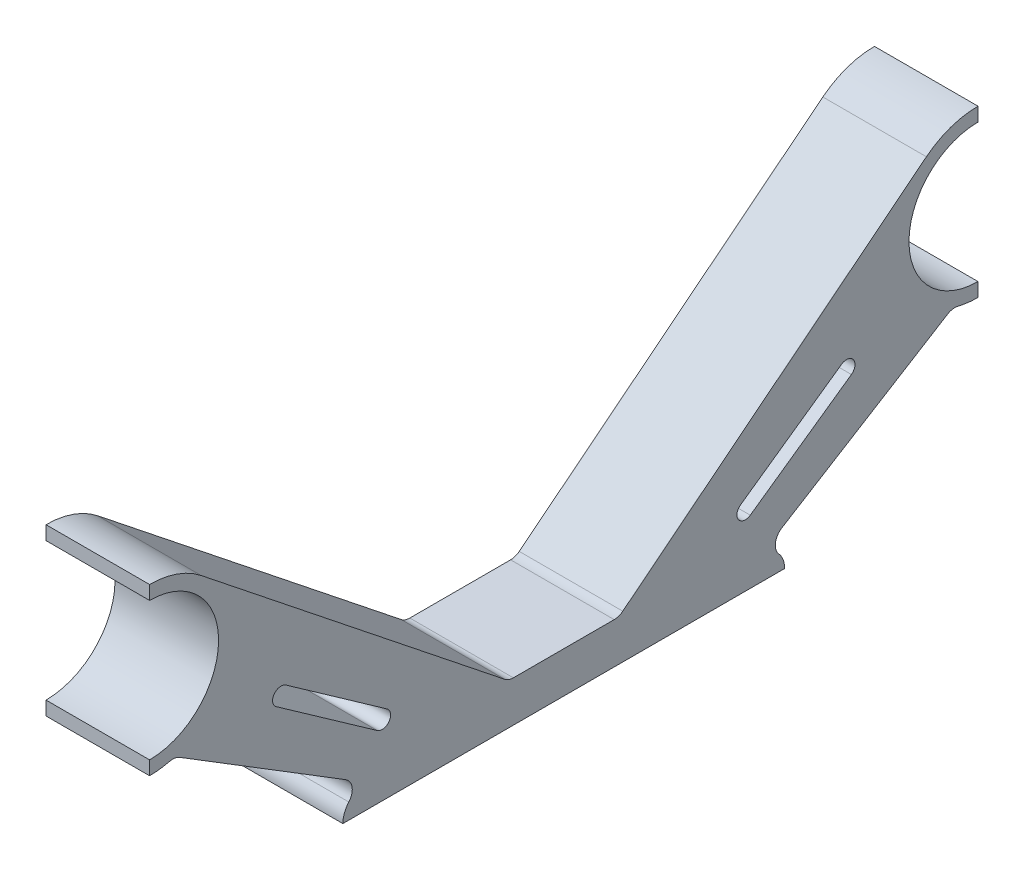
ISO-10303-21;
HEADER;
FILE_DESCRIPTION(('STEP AP214'),'2;1');
FILE_NAME('part.step','',(''),(''),'','','');
FILE_SCHEMA(('AUTOMOTIVE_DESIGN { 1 0 10303 214 1 1 1 1 }'));
ENDSEC;
DATA;
#1=APPLICATION_CONTEXT('core data for automotive mechanical design processes');
#2=APPLICATION_PROTOCOL_DEFINITION('international standard','automotive_design',2000,#1);
#3=PRODUCT_CONTEXT('',#1,'mechanical');
#4=PRODUCT('Part','Part','',(#3));
#5=PRODUCT_RELATED_PRODUCT_CATEGORY('part','',(#4));
#6=PRODUCT_DEFINITION_FORMATION('','',#4);
#7=PRODUCT_DEFINITION_CONTEXT('part definition',#1,'design');
#8=PRODUCT_DEFINITION('design','',#6,#7);
#9=PRODUCT_DEFINITION_SHAPE('','',#8);
#10=(LENGTH_UNIT() NAMED_UNIT(*) SI_UNIT(.MILLI.,.METRE.));
#11=(NAMED_UNIT(*) PLANE_ANGLE_UNIT() SI_UNIT($,.RADIAN.));
#12=(NAMED_UNIT(*) SI_UNIT($,.STERADIAN.) SOLID_ANGLE_UNIT());
#13=UNCERTAINTY_MEASURE_WITH_UNIT(LENGTH_MEASURE(1.E-05),#10,'distance_accuracy_value','');
#14=(GEOMETRIC_REPRESENTATION_CONTEXT(3) GLOBAL_UNCERTAINTY_ASSIGNED_CONTEXT((#13)) GLOBAL_UNIT_ASSIGNED_CONTEXT((#10,
#11,#12)) REPRESENTATION_CONTEXT('',''));
#15=CARTESIAN_POINT('',(0.,0.,0.));
#16=DIRECTION('',(0.,0.,1.));
#17=DIRECTION('',(1.,0.,0.));
#18=AXIS2_PLACEMENT_3D('',#15,#16,#17);
#19=CARTESIAN_POINT('',(3.75,16.,30.));
#20=DIRECTION('',(1.,0.,0.));
#21=DIRECTION('',(0.,0.,-1.));
#22=AXIS2_PLACEMENT_3D('',#19,#20,#21);
#23=PLANE('',#22);
#24=CARTESIAN_POINT('',(3.75,16.,30.));
#25=DIRECTION('',(1.,0.,0.));
#26=DIRECTION('',(0.,0.,-1.));
#27=AXIS2_PLACEMENT_3D('',#24,#25,#26);
#28=CIRCLE('',#27,6.);
#29=CARTESIAN_POINT('',(3.75,20.6940977194005,26.2629628579958));
#30=VERTEX_POINT('',#29);
#31=CARTESIAN_POINT('',(3.75,22.,30.));
#32=VERTEX_POINT('',#31);
#33=EDGE_CURVE('E314',#30,#32,#28,.T.);
#34=ORIENTED_EDGE('',*,*,#33,.T.);
#35=DIRECTION('',(0.,-1.,0.));
#36=VECTOR('',#35,1.);
#37=CARTESIAN_POINT('',(3.75,22.,30.));
#38=LINE('',#37,#36);
#39=CARTESIAN_POINT('',(3.75,21.,30.));
#40=VERTEX_POINT('',#39);
#41=EDGE_CURVE('E317',#32,#40,#38,.T.);
#42=ORIENTED_EDGE('',*,*,#41,.T.);
#43=CARTESIAN_POINT('',(3.75,16.,30.));
#44=DIRECTION('',(-1.,0.,0.));
#45=DIRECTION('',(0.,0.,-1.));
#46=AXIS2_PLACEMENT_3D('',#43,#44,#45);
#47=CIRCLE('',#46,5.);
#48=CARTESIAN_POINT('',(3.75,11.,30.));
#49=VERTEX_POINT('',#48);
#50=EDGE_CURVE('E320',#40,#49,#47,.T.);
#51=ORIENTED_EDGE('',*,*,#50,.T.);
#52=DIRECTION('',(0.,-1.,0.));
#53=VECTOR('',#52,1.);
#54=CARTESIAN_POINT('',(3.75,11.,30.));
#55=LINE('',#54,#53);
#56=CARTESIAN_POINT('',(3.75,10.,30.));
#57=VERTEX_POINT('',#56);
#58=EDGE_CURVE('E322',#49,#57,#55,.T.);
#59=ORIENTED_EDGE('',*,*,#58,.T.);
#60=CARTESIAN_POINT('',(3.75,16.,30.));
#61=DIRECTION('',(1.,0.,0.));
#62=DIRECTION('',(0.,0.,-1.));
#63=AXIS2_PLACEMENT_3D('',#60,#61,#62);
#64=CIRCLE('',#63,6.);
#65=CARTESIAN_POINT('',(3.75,10.174223423799,28.5646159802381));
#66=VERTEX_POINT('',#65);
#67=EDGE_CURVE('E324',#57,#66,#64,.T.);
#68=ORIENTED_EDGE('',*,*,#67,.T.);
#69=CARTESIAN_POINT('',(3.75,9.20326066109884,28.3253853102778));
#70=DIRECTION('',(1.,0.,0.));
#71=DIRECTION('',(0.,0.,-1.));
#72=AXIS2_PLACEMENT_3D('',#69,#70,#71);
#73=CIRCLE('',#72,1.);
#74=CARTESIAN_POINT('',(3.75,10.0545312194039,27.8006582988109));
#75=VERTEX_POINT('',#74);
#76=EDGE_CURVE('E465',#66,#75,#73,.F.);
#77=ORIENTED_EDGE('',*,*,#76,.T.);
#78=DIRECTION('',(0.,-0.524727011466857,-0.851270558305091));
#79=VECTOR('',#78,1.);
#80=CARTESIAN_POINT('',(3.75,1.7202081560025,14.2797918439975));
#81=LINE('',#80,#79);
#82=CARTESIAN_POINT('',(3.75,2.65298394317207,15.7930445406665));
#83=VERTEX_POINT('',#82);
#84=EDGE_CURVE('E327',#75,#83,#81,.T.);
#85=ORIENTED_EDGE('',*,*,#84,.T.);
#86=CARTESIAN_POINT('',(3.75,1.80171338486698,16.3177715521334));
#87=DIRECTION('',(1.,0.,0.));
#88=DIRECTION('',(0.,0.,-1.));
#89=AXIS2_PLACEMENT_3D('',#86,#87,#88);
#90=CIRCLE('',#89,1.);
#91=CARTESIAN_POINT('',(3.75,1.13936944589626,15.5685716412226));
#92=VERTEX_POINT('',#91);
#93=EDGE_CURVE('E11',#83,#92,#90,.F.);
#94=ORIENTED_EDGE('',*,*,#93,.T.);
#95=CARTESIAN_POINT('',(3.75,0.,14.2797918439975));
#96=DIRECTION('',(1.,0.,0.));
#97=DIRECTION('',(0.,0.,-1.));
#98=AXIS2_PLACEMENT_3D('',#95,#96,#97);
#99=CIRCLE('',#98,1.7202081560025);
#100=CARTESIAN_POINT('',(3.75,0.,16.));
#101=VERTEX_POINT('',#100);
#102=EDGE_CURVE('E329',#92,#101,#99,.T.);
#103=ORIENTED_EDGE('',*,*,#102,.T.);
#104=DIRECTION('',(0.,0.,-1.));
#105=VECTOR('',#104,1.);
#106=CARTESIAN_POINT('',(3.75,0.,-16.));
#107=LINE('',#106,#105);
#108=CARTESIAN_POINT('',(3.75,0.,-16.));
#109=VERTEX_POINT('',#108);
#110=EDGE_CURVE('E331',#101,#109,#107,.T.);
#111=ORIENTED_EDGE('',*,*,#110,.T.);
#112=CARTESIAN_POINT('',(3.75,0.,-14.2797918439975));
#113=DIRECTION('',(1.,0.,0.));
#114=DIRECTION('',(0.,0.,1.));
#115=AXIS2_PLACEMENT_3D('',#112,#113,#114);
#116=CIRCLE('',#115,1.7202081560025);
#117=CARTESIAN_POINT('',(3.75,1.13936944589626,-15.5685716412226));
#118=VERTEX_POINT('',#117);
#119=EDGE_CURVE('E333',#109,#118,#116,.T.);
#120=ORIENTED_EDGE('',*,*,#119,.T.);
#121=CARTESIAN_POINT('',(3.75,1.80171338486698,-16.3177715521334));
#122=DIRECTION('',(1.,0.,0.));
#123=DIRECTION('',(0.,0.,-1.));
#124=AXIS2_PLACEMENT_3D('',#121,#122,#123);
#125=CIRCLE('',#124,1.);
#126=CARTESIAN_POINT('',(3.75,2.65298394317207,-15.7930445406665));
#127=VERTEX_POINT('',#126);
#128=EDGE_CURVE('E481',#118,#127,#125,.F.);
#129=ORIENTED_EDGE('',*,*,#128,.T.);
#130=DIRECTION('',(0.,0.524727011466857,-0.851270558305091));
#131=VECTOR('',#130,1.);
#132=CARTESIAN_POINT('',(3.75,1.7202081560025,-14.2797918439975));
#133=LINE('',#132,#131);
#134=CARTESIAN_POINT('',(3.75,10.0545312194039,-27.8006582988109));
#135=VERTEX_POINT('',#134);
#136=EDGE_CURVE('E336',#127,#135,#133,.T.);
#137=ORIENTED_EDGE('',*,*,#136,.T.);
#138=CARTESIAN_POINT('',(3.75,9.20326066109884,-28.3253853102778));
#139=DIRECTION('',(1.,0.,0.));
#140=DIRECTION('',(0.,0.,-1.));
#141=AXIS2_PLACEMENT_3D('',#138,#139,#140);
#142=CIRCLE('',#141,1.);
#143=CARTESIAN_POINT('',(3.75,10.174223423799,-28.5646159802381));
#144=VERTEX_POINT('',#143);
#145=EDGE_CURVE('E469',#135,#144,#142,.F.);
#146=ORIENTED_EDGE('',*,*,#145,.T.);
#147=CARTESIAN_POINT('',(3.75,16.,-30.));
#148=DIRECTION('',(1.,0.,0.));
#149=DIRECTION('',(0.,0.,1.));
#150=AXIS2_PLACEMENT_3D('',#147,#148,#149);
#151=CIRCLE('',#150,6.);
#152=CARTESIAN_POINT('',(3.75,10.,-30.));
#153=VERTEX_POINT('',#152);
#154=EDGE_CURVE('E339',#144,#153,#151,.T.);
#155=ORIENTED_EDGE('',*,*,#154,.T.);
#156=DIRECTION('',(0.,1.,0.));
#157=VECTOR('',#156,1.);
#158=CARTESIAN_POINT('',(3.75,11.,-30.));
#159=LINE('',#158,#157);
#160=CARTESIAN_POINT('',(3.75,11.,-30.));
#161=VERTEX_POINT('',#160);
#162=EDGE_CURVE('E341',#153,#161,#159,.T.);
#163=ORIENTED_EDGE('',*,*,#162,.T.);
#164=CARTESIAN_POINT('',(3.75,16.,-30.));
#165=DIRECTION('',(-1.,0.,0.));
#166=DIRECTION('',(0.,0.,1.));
#167=AXIS2_PLACEMENT_3D('',#164,#165,#166);
#168=CIRCLE('',#167,5.);
#169=CARTESIAN_POINT('',(3.75,21.,-30.));
#170=VERTEX_POINT('',#169);
#171=EDGE_CURVE('E343',#161,#170,#168,.T.);
#172=ORIENTED_EDGE('',*,*,#171,.T.);
#173=DIRECTION('',(0.,1.,0.));
#174=VECTOR('',#173,1.);
#175=CARTESIAN_POINT('',(3.75,22.,-30.));
#176=LINE('',#175,#174);
#177=CARTESIAN_POINT('',(3.75,22.,-30.));
#178=VERTEX_POINT('',#177);
#179=EDGE_CURVE('E345',#170,#178,#176,.T.);
#180=ORIENTED_EDGE('',*,*,#179,.T.);
#181=CARTESIAN_POINT('',(3.75,16.,-30.));
#182=DIRECTION('',(1.,0.,0.));
#183=DIRECTION('',(0.,0.,1.));
#184=AXIS2_PLACEMENT_3D('',#181,#182,#183);
#185=CIRCLE('',#184,6.);
#186=CARTESIAN_POINT('',(3.75,20.6940977194005,-26.2629628579958));
#187=VERTEX_POINT('',#186);
#188=EDGE_CURVE('E347',#178,#187,#185,.T.);
#189=ORIENTED_EDGE('',*,*,#188,.T.);
#190=DIRECTION('',(0.,-0.622839523667361,0.78234961990009));
#191=VECTOR('',#190,1.);
#192=CARTESIAN_POINT('',(3.75,2.97024021478636,-4.));
#193=LINE('',#192,#191);
#194=CARTESIAN_POINT('',(3.75,3.18789059488627,-4.27339095492793));
#195=VERTEX_POINT('',#194);
#196=EDGE_CURVE('E349',#187,#195,#193,.T.);
#197=ORIENTED_EDGE('',*,*,#196,.T.);
#198=CARTESIAN_POINT('',(3.75,3.97024021478636,-3.65055143126057));
#199=DIRECTION('',(1.,0.,0.));
#200=DIRECTION('',(0.,0.,-1.));
#201=AXIS2_PLACEMENT_3D('',#198,#199,#200);
#202=CIRCLE('',#201,1.);
#203=CARTESIAN_POINT('',(3.75,2.97024021478636,-3.65055143126057));
#204=VERTEX_POINT('',#203);
#205=EDGE_CURVE('E477',#195,#204,#202,.F.);
#206=ORIENTED_EDGE('',*,*,#205,.T.);
#207=DIRECTION('',(0.,0.,1.));
#208=VECTOR('',#207,1.);
#209=CARTESIAN_POINT('',(3.75,2.97024021478636,-4.));
#210=LINE('',#209,#208);
#211=CARTESIAN_POINT('',(3.75,2.97024021478636,3.65055143126057));
#212=VERTEX_POINT('',#211);
#213=EDGE_CURVE('E352',#204,#212,#210,.T.);
#214=ORIENTED_EDGE('',*,*,#213,.T.);
#215=CARTESIAN_POINT('',(3.75,3.97024021478636,3.65055143126057));
#216=DIRECTION('',(1.,0.,0.));
#217=DIRECTION('',(0.,0.,-1.));
#218=AXIS2_PLACEMENT_3D('',#215,#216,#217);
#219=CIRCLE('',#218,1.);
#220=CARTESIAN_POINT('',(3.75,3.18789059488627,4.27339095492793));
#221=VERTEX_POINT('',#220);
#222=EDGE_CURVE('E473',#212,#221,#219,.F.);
#223=ORIENTED_EDGE('',*,*,#222,.T.);
#224=DIRECTION('',(0.,0.622839523667361,0.78234961990009));
#225=VECTOR('',#224,1.);
#226=CARTESIAN_POINT('',(3.75,2.97024021478636,4.));
#227=LINE('',#226,#225);
#228=EDGE_CURVE('E355',#221,#30,#227,.T.);
#229=ORIENTED_EDGE('',*,*,#228,.T.);
#230=EDGE_LOOP('',(#34,#42,#51,#59,#68,#77,#85,#94,#103,#111,#120,#129,#137,#146,#155,#163,#172,
#180,#189,#197,#206,#214,#223,#229));
#231=FACE_BOUND('',#230,.T.);
#232=DIRECTION('',(0.,-0.575984888012546,-0.817460340800197));
#233=VECTOR('',#232,1.);
#234=CARTESIAN_POINT('',(3.75,9.75347592584614,20.8313008095347));
#235=LINE('',#234,#233);
#236=CARTESIAN_POINT('',(3.75,9.75347592584614,20.8313008095347));
#237=VERTEX_POINT('',#236);
#238=CARTESIAN_POINT('',(3.75,4.59240645157694,13.5065086159629));
#239=VERTEX_POINT('',#238);
#240=EDGE_CURVE('E285',#237,#239,#235,.T.);
#241=ORIENTED_EDGE('',*,*,#240,.F.);
#242=CARTESIAN_POINT('',(3.75,10.2541152812989,20.4785488915604));
#243=DIRECTION('',(1.,0.,0.));
#244=DIRECTION('',(0.,0.,-1.));
#245=AXIS2_PLACEMENT_3D('',#242,#243,#244);
#246=CIRCLE('',#245,0.61243259209704);
#247=CARTESIAN_POINT('',(3.75,10.7547546367517,20.1257969735862));
#248=VERTEX_POINT('',#247);
#249=EDGE_CURVE('E283',#248,#237,#246,.T.);
#250=ORIENTED_EDGE('',*,*,#249,.F.);
#251=DIRECTION('',(0.,0.575984888012546,0.817460340800197));
#252=VECTOR('',#251,1.);
#253=CARTESIAN_POINT('',(3.75,10.7547546367517,20.1257969735862));
#254=LINE('',#253,#252);
#255=CARTESIAN_POINT('',(3.75,5.59368516248254,12.8010047800144));
#256=VERTEX_POINT('',#255);
#257=EDGE_CURVE('E291',#256,#248,#254,.T.);
#258=ORIENTED_EDGE('',*,*,#257,.F.);
#259=CARTESIAN_POINT('',(3.75,5.09304580702974,13.1537566979887));
#260=DIRECTION('',(1.,0.,0.));
#261=DIRECTION('',(0.,0.,-1.));
#262=AXIS2_PLACEMENT_3D('',#259,#260,#261);
#263=CIRCLE('',#262,0.61243259209704);
#264=EDGE_CURVE('E288',#239,#256,#263,.T.);
#265=ORIENTED_EDGE('',*,*,#264,.F.);
#266=EDGE_LOOP('',(#241,#250,#258,#265));
#267=FACE_BOUND('',#266,.T.);
#268=DIRECTION('',(0.,-0.575984888012546,0.817460340800197));
#269=VECTOR('',#268,1.);
#270=CARTESIAN_POINT('',(3.75,10.7547546367517,-20.1257969735862));
#271=LINE('',#270,#269);
#272=CARTESIAN_POINT('',(3.75,10.7547546367517,-20.1257969735862));
#273=VERTEX_POINT('',#272);
#274=CARTESIAN_POINT('',(3.75,5.59368516248253,-12.8010047800144));
#275=VERTEX_POINT('',#274);
#276=EDGE_CURVE('E252',#273,#275,#271,.T.);
#277=ORIENTED_EDGE('',*,*,#276,.F.);
#278=CARTESIAN_POINT('',(3.75,10.2541152812989,-20.4785488915604));
#279=DIRECTION('',(1.,0.,0.));
#280=DIRECTION('',(0.,0.,1.));
#281=AXIS2_PLACEMENT_3D('',#278,#279,#280);
#282=CIRCLE('',#281,0.61243259209704);
#283=CARTESIAN_POINT('',(3.75,9.75347592584614,-20.8313008095347));
#284=VERTEX_POINT('',#283);
#285=EDGE_CURVE('E242',#284,#273,#282,.T.);
#286=ORIENTED_EDGE('',*,*,#285,.F.);
#287=DIRECTION('',(0.,0.575984888012546,-0.817460340800197));
#288=VECTOR('',#287,1.);
#289=CARTESIAN_POINT('',(3.75,9.75347592584614,-20.8313008095347));
#290=LINE('',#289,#288);
#291=CARTESIAN_POINT('',(3.75,4.59240645157693,-13.5065086159629));
#292=VERTEX_POINT('',#291);
#293=EDGE_CURVE('E267',#292,#284,#290,.T.);
#294=ORIENTED_EDGE('',*,*,#293,.F.);
#295=CARTESIAN_POINT('',(3.75,5.09304580702974,-13.1537566979887));
#296=DIRECTION('',(1.,0.,0.));
#297=DIRECTION('',(0.,0.,1.));
#298=AXIS2_PLACEMENT_3D('',#295,#296,#297);
#299=CIRCLE('',#298,0.61243259209704);
#300=EDGE_CURVE('E265',#275,#292,#299,.T.);
#301=ORIENTED_EDGE('',*,*,#300,.F.);
#302=EDGE_LOOP('',(#277,#286,#294,#301));
#303=FACE_BOUND('',#302,.T.);
#304=ADVANCED_FACE('F33',(#231,#267,#303),#23,.T.);
#305=CARTESIAN_POINT('',(-3.75,16.,30.));
#306=DIRECTION('',(1.,0.,0.));
#307=DIRECTION('',(0.,0.,-1.));
#308=AXIS2_PLACEMENT_3D('',#305,#306,#307);
#309=PLANE('',#308);
#310=CARTESIAN_POINT('',(-3.75,10.2541152812989,20.4785488915604));
#311=DIRECTION('',(1.,0.,0.));
#312=DIRECTION('',(0.,0.,-1.));
#313=AXIS2_PLACEMENT_3D('',#310,#311,#312);
#314=CIRCLE('',#313,0.61243259209704);
#315=CARTESIAN_POINT('',(-3.75,10.7547546367517,20.1257969735862));
#316=VERTEX_POINT('',#315);
#317=CARTESIAN_POINT('',(-3.75,9.75347592584614,20.8313008095347));
#318=VERTEX_POINT('',#317);
#319=EDGE_CURVE('E260',#316,#318,#314,.T.);
#320=ORIENTED_EDGE('',*,*,#319,.T.);
#321=DIRECTION('',(0.,-0.575984888012546,-0.817460340800197));
#322=VECTOR('',#321,1.);
#323=CARTESIAN_POINT('',(-3.75,9.75347592584614,20.8313008095347));
#324=LINE('',#323,#322);
#325=CARTESIAN_POINT('',(-3.75,4.59240645157694,13.5065086159629));
#326=VERTEX_POINT('',#325);
#327=EDGE_CURVE('E296',#318,#326,#324,.T.);
#328=ORIENTED_EDGE('',*,*,#327,.T.);
#329=CARTESIAN_POINT('',(-3.75,5.09304580702974,13.1537566979887));
#330=DIRECTION('',(1.,0.,0.));
#331=DIRECTION('',(0.,0.,-1.));
#332=AXIS2_PLACEMENT_3D('',#329,#330,#331);
#333=CIRCLE('',#332,0.61243259209704);
#334=CARTESIAN_POINT('',(-3.75,5.59368516248253,12.8010047800144));
#335=VERTEX_POINT('',#334);
#336=EDGE_CURVE('E299',#326,#335,#333,.T.);
#337=ORIENTED_EDGE('',*,*,#336,.T.);
#338=DIRECTION('',(0.,0.575984888012546,0.817460340800197));
#339=VECTOR('',#338,1.);
#340=CARTESIAN_POINT('',(-3.75,10.7547546367517,20.1257969735862));
#341=LINE('',#340,#339);
#342=EDGE_CURVE('E286',#335,#316,#341,.T.);
#343=ORIENTED_EDGE('',*,*,#342,.T.);
#344=EDGE_LOOP('',(#320,#328,#337,#343));
#345=FACE_BOUND('',#344,.T.);
#346=CARTESIAN_POINT('',(-3.75,16.,30.));
#347=DIRECTION('',(1.,0.,0.));
#348=DIRECTION('',(0.,0.,-1.));
#349=AXIS2_PLACEMENT_3D('',#346,#347,#348);
#350=CIRCLE('',#349,6.);
#351=CARTESIAN_POINT('',(-3.75,20.6940977194005,26.2629628579958));
#352=VERTEX_POINT('',#351);
#353=CARTESIAN_POINT('',(-3.75,22.,30.));
#354=VERTEX_POINT('',#353);
#355=EDGE_CURVE('E313',#352,#354,#350,.T.);
#356=ORIENTED_EDGE('',*,*,#355,.F.);
#357=DIRECTION('',(0.,0.622839523667361,0.78234961990009));
#358=VECTOR('',#357,1.);
#359=CARTESIAN_POINT('',(-3.75,2.97024021478636,4.));
#360=LINE('',#359,#358);
#361=CARTESIAN_POINT('',(-3.75,3.18789059488627,4.27339095492793));
#362=VERTEX_POINT('',#361);
#363=EDGE_CURVE('E318',#362,#352,#360,.T.);
#364=ORIENTED_EDGE('',*,*,#363,.F.);
#365=CARTESIAN_POINT('',(-3.75,3.97024021478636,3.65055143126057));
#366=DIRECTION('',(1.,0.,0.));
#367=DIRECTION('',(0.,0.,-1.));
#368=AXIS2_PLACEMENT_3D('',#365,#366,#367);
#369=CIRCLE('',#368,1.);
#370=CARTESIAN_POINT('',(-3.75,2.97024021478636,3.65055143126057));
#371=VERTEX_POINT('',#370);
#372=EDGE_CURVE('E471',#362,#371,#369,.T.);
#373=ORIENTED_EDGE('',*,*,#372,.T.);
#374=DIRECTION('',(0.,0.,1.));
#375=VECTOR('',#374,1.);
#376=CARTESIAN_POINT('',(-3.75,2.97024021478636,-4.));
#377=LINE('',#376,#375);
#378=CARTESIAN_POINT('',(-3.75,2.97024021478636,-3.65055143126057));
#379=VERTEX_POINT('',#378);
#380=EDGE_CURVE('E395',#379,#371,#377,.T.);
#381=ORIENTED_EDGE('',*,*,#380,.F.);
#382=CARTESIAN_POINT('',(-3.75,3.97024021478636,-3.65055143126057));
#383=DIRECTION('',(1.,0.,0.));
#384=DIRECTION('',(0.,0.,-1.));
#385=AXIS2_PLACEMENT_3D('',#382,#383,#384);
#386=CIRCLE('',#385,1.);
#387=CARTESIAN_POINT('',(-3.75,3.18789059488627,-4.27339095492793));
#388=VERTEX_POINT('',#387);
#389=EDGE_CURVE('E475',#379,#388,#386,.T.);
#390=ORIENTED_EDGE('',*,*,#389,.T.);
#391=DIRECTION('',(0.,-0.622839523667361,0.78234961990009));
#392=VECTOR('',#391,1.);
#393=CARTESIAN_POINT('',(-3.75,2.97024021478636,-4.));
#394=LINE('',#393,#392);
#395=CARTESIAN_POINT('',(-3.75,20.6940977194005,-26.2629628579958));
#396=VERTEX_POINT('',#395);
#397=EDGE_CURVE('E392',#396,#388,#394,.T.);
#398=ORIENTED_EDGE('',*,*,#397,.F.);
#399=CARTESIAN_POINT('',(-3.75,16.,-30.));
#400=DIRECTION('',(1.,0.,0.));
#401=DIRECTION('',(0.,0.,1.));
#402=AXIS2_PLACEMENT_3D('',#399,#400,#401);
#403=CIRCLE('',#402,6.);
#404=CARTESIAN_POINT('',(-3.75,22.,-30.));
#405=VERTEX_POINT('',#404);
#406=EDGE_CURVE('E390',#405,#396,#403,.T.);
#407=ORIENTED_EDGE('',*,*,#406,.F.);
#408=DIRECTION('',(0.,1.,0.));
#409=VECTOR('',#408,1.);
#410=CARTESIAN_POINT('',(-3.75,22.,-30.));
#411=LINE('',#410,#409);
#412=CARTESIAN_POINT('',(-3.75,21.,-30.));
#413=VERTEX_POINT('',#412);
#414=EDGE_CURVE('E388',#413,#405,#411,.T.);
#415=ORIENTED_EDGE('',*,*,#414,.F.);
#416=CARTESIAN_POINT('',(-3.75,16.,-30.));
#417=DIRECTION('',(-1.,0.,0.));
#418=DIRECTION('',(0.,0.,1.));
#419=AXIS2_PLACEMENT_3D('',#416,#417,#418);
#420=CIRCLE('',#419,5.);
#421=CARTESIAN_POINT('',(-3.75,11.,-30.));
#422=VERTEX_POINT('',#421);
#423=EDGE_CURVE('E386',#422,#413,#420,.T.);
#424=ORIENTED_EDGE('',*,*,#423,.F.);
#425=DIRECTION('',(0.,1.,0.));
#426=VECTOR('',#425,1.);
#427=CARTESIAN_POINT('',(-3.75,11.,-30.));
#428=LINE('',#427,#426);
#429=CARTESIAN_POINT('',(-3.75,10.,-30.));
#430=VERTEX_POINT('',#429);
#431=EDGE_CURVE('E384',#430,#422,#428,.T.);
#432=ORIENTED_EDGE('',*,*,#431,.F.);
#433=CARTESIAN_POINT('',(-3.75,16.,-30.));
#434=DIRECTION('',(1.,0.,0.));
#435=DIRECTION('',(0.,0.,1.));
#436=AXIS2_PLACEMENT_3D('',#433,#434,#435);
#437=CIRCLE('',#436,6.);
#438=CARTESIAN_POINT('',(-3.75,10.174223423799,-28.5646159802381));
#439=VERTEX_POINT('',#438);
#440=EDGE_CURVE('E382',#439,#430,#437,.T.);
#441=ORIENTED_EDGE('',*,*,#440,.F.);
#442=CARTESIAN_POINT('',(-3.75,9.20326066109884,-28.3253853102778));
#443=DIRECTION('',(1.,0.,0.));
#444=DIRECTION('',(0.,0.,-1.));
#445=AXIS2_PLACEMENT_3D('',#442,#443,#444);
#446=CIRCLE('',#445,1.);
#447=CARTESIAN_POINT('',(-3.75,10.0545312194039,-27.8006582988109));
#448=VERTEX_POINT('',#447);
#449=EDGE_CURVE('E467',#439,#448,#446,.T.);
#450=ORIENTED_EDGE('',*,*,#449,.T.);
#451=DIRECTION('',(0.,0.524727011466857,-0.851270558305091));
#452=VECTOR('',#451,1.);
#453=CARTESIAN_POINT('',(-3.75,1.7202081560025,-14.2797918439975));
#454=LINE('',#453,#452);
#455=CARTESIAN_POINT('',(-3.75,2.65298394317207,-15.7930445406665));
#456=VERTEX_POINT('',#455);
#457=EDGE_CURVE('E379',#456,#448,#454,.T.);
#458=ORIENTED_EDGE('',*,*,#457,.F.);
#459=CARTESIAN_POINT('',(-3.75,1.80171338486698,-16.3177715521334));
#460=DIRECTION('',(1.,0.,0.));
#461=DIRECTION('',(0.,0.,-1.));
#462=AXIS2_PLACEMENT_3D('',#459,#460,#461);
#463=CIRCLE('',#462,1.);
#464=CARTESIAN_POINT('',(-3.75,1.13936944589626,-15.5685716412226));
#465=VERTEX_POINT('',#464);
#466=EDGE_CURVE('E479',#456,#465,#463,.T.);
#467=ORIENTED_EDGE('',*,*,#466,.T.);
#468=CARTESIAN_POINT('',(-3.75,0.,-14.2797918439975));
#469=DIRECTION('',(1.,0.,0.));
#470=DIRECTION('',(0.,0.,1.));
#471=AXIS2_PLACEMENT_3D('',#468,#469,#470);
#472=CIRCLE('',#471,1.7202081560025);
#473=CARTESIAN_POINT('',(-3.75,0.,-16.));
#474=VERTEX_POINT('',#473);
#475=EDGE_CURVE('E376',#474,#465,#472,.T.);
#476=ORIENTED_EDGE('',*,*,#475,.F.);
#477=DIRECTION('',(0.,0.,-1.));
#478=VECTOR('',#477,1.);
#479=CARTESIAN_POINT('',(-3.75,0.,-16.));
#480=LINE('',#479,#478);
#481=CARTESIAN_POINT('',(-3.75,0.,16.));
#482=VERTEX_POINT('',#481);
#483=EDGE_CURVE('E374',#482,#474,#480,.T.);
#484=ORIENTED_EDGE('',*,*,#483,.F.);
#485=CARTESIAN_POINT('',(-3.75,0.,14.2797918439975));
#486=DIRECTION('',(1.,0.,0.));
#487=DIRECTION('',(0.,0.,-1.));
#488=AXIS2_PLACEMENT_3D('',#485,#486,#487);
#489=CIRCLE('',#488,1.7202081560025);
#490=CARTESIAN_POINT('',(-3.75,1.13936944589626,15.5685716412226));
#491=VERTEX_POINT('',#490);
#492=EDGE_CURVE('E372',#491,#482,#489,.T.);
#493=ORIENTED_EDGE('',*,*,#492,.F.);
#494=CARTESIAN_POINT('',(-3.75,1.80171338486698,16.3177715521334));
#495=DIRECTION('',(1.,0.,0.));
#496=DIRECTION('',(0.,0.,-1.));
#497=AXIS2_PLACEMENT_3D('',#494,#495,#496);
#498=CIRCLE('',#497,1.);
#499=CARTESIAN_POINT('',(-3.75,2.65298394317207,15.7930445406665));
#500=VERTEX_POINT('',#499);
#501=EDGE_CURVE('E41',#491,#500,#498,.T.);
#502=ORIENTED_EDGE('',*,*,#501,.T.);
#503=DIRECTION('',(0.,-0.524727011466857,-0.851270558305091));
#504=VECTOR('',#503,1.);
#505=CARTESIAN_POINT('',(-3.75,1.7202081560025,14.2797918439975));
#506=LINE('',#505,#504);
#507=CARTESIAN_POINT('',(-3.75,10.0545312194039,27.8006582988109));
#508=VERTEX_POINT('',#507);
#509=EDGE_CURVE('E369',#508,#500,#506,.T.);
#510=ORIENTED_EDGE('',*,*,#509,.F.);
#511=CARTESIAN_POINT('',(-3.75,9.20326066109884,28.3253853102778));
#512=DIRECTION('',(1.,0.,0.));
#513=DIRECTION('',(0.,0.,-1.));
#514=AXIS2_PLACEMENT_3D('',#511,#512,#513);
#515=CIRCLE('',#514,1.);
#516=CARTESIAN_POINT('',(-3.75,10.174223423799,28.5646159802381));
#517=VERTEX_POINT('',#516);
#518=EDGE_CURVE('E463',#508,#517,#515,.T.);
#519=ORIENTED_EDGE('',*,*,#518,.T.);
#520=CARTESIAN_POINT('',(-3.75,16.,30.));
#521=DIRECTION('',(1.,0.,0.));
#522=DIRECTION('',(0.,0.,-1.));
#523=AXIS2_PLACEMENT_3D('',#520,#521,#522);
#524=CIRCLE('',#523,6.);
#525=CARTESIAN_POINT('',(-3.75,10.,30.));
#526=VERTEX_POINT('',#525);
#527=EDGE_CURVE('E366',#526,#517,#524,.T.);
#528=ORIENTED_EDGE('',*,*,#527,.F.);
#529=DIRECTION('',(0.,-1.,0.));
#530=VECTOR('',#529,1.);
#531=CARTESIAN_POINT('',(-3.75,11.,30.));
#532=LINE('',#531,#530);
#533=CARTESIAN_POINT('',(-3.75,11.,30.));
#534=VERTEX_POINT('',#533);
#535=EDGE_CURVE('E364',#534,#526,#532,.T.);
#536=ORIENTED_EDGE('',*,*,#535,.F.);
#537=CARTESIAN_POINT('',(-3.75,16.,30.));
#538=DIRECTION('',(-1.,0.,0.));
#539=DIRECTION('',(0.,0.,-1.));
#540=AXIS2_PLACEMENT_3D('',#537,#538,#539);
#541=CIRCLE('',#540,5.);
#542=CARTESIAN_POINT('',(-3.75,21.,30.));
#543=VERTEX_POINT('',#542);
#544=EDGE_CURVE('E362',#543,#534,#541,.T.);
#545=ORIENTED_EDGE('',*,*,#544,.F.);
#546=DIRECTION('',(0.,-1.,0.));
#547=VECTOR('',#546,1.);
#548=CARTESIAN_POINT('',(-3.75,22.,30.));
#549=LINE('',#548,#547);
#550=EDGE_CURVE('E360',#354,#543,#549,.T.);
#551=ORIENTED_EDGE('',*,*,#550,.F.);
#552=EDGE_LOOP('',(#356,#364,#373,#381,#390,#398,#407,#415,#424,#432,#441,#450,#458,#467,#476,
#484,#493,#502,#510,#519,#528,#536,#545,#551));
#553=FACE_BOUND('',#552,.T.);
#554=CARTESIAN_POINT('',(-3.75,10.2541152812989,-20.4785488915604));
#555=DIRECTION('',(1.,0.,0.));
#556=DIRECTION('',(0.,0.,1.));
#557=AXIS2_PLACEMENT_3D('',#554,#555,#556);
#558=CIRCLE('',#557,0.61243259209704);
#559=CARTESIAN_POINT('',(-3.75,9.75347592584613,-20.8313008095347));
#560=VERTEX_POINT('',#559);
#561=CARTESIAN_POINT('',(-3.75,10.7547546367517,-20.1257969735862));
#562=VERTEX_POINT('',#561);
#563=EDGE_CURVE('E271',#560,#562,#558,.T.);
#564=ORIENTED_EDGE('',*,*,#563,.T.);
#565=DIRECTION('',(0.,-0.575984888012546,0.817460340800197));
#566=VECTOR('',#565,1.);
#567=CARTESIAN_POINT('',(-3.75,10.7547546367517,-20.1257969735862));
#568=LINE('',#567,#566);
#569=CARTESIAN_POINT('',(-3.75,5.59368516248253,-12.8010047800144));
#570=VERTEX_POINT('',#569);
#571=EDGE_CURVE('E259',#562,#570,#568,.T.);
#572=ORIENTED_EDGE('',*,*,#571,.T.);
#573=CARTESIAN_POINT('',(-3.75,5.09304580702974,-13.1537566979887));
#574=DIRECTION('',(1.,0.,0.));
#575=DIRECTION('',(0.,0.,1.));
#576=AXIS2_PLACEMENT_3D('',#573,#574,#575);
#577=CIRCLE('',#576,0.61243259209704);
#578=CARTESIAN_POINT('',(-3.75,4.59240645157694,-13.5065086159629));
#579=VERTEX_POINT('',#578);
#580=EDGE_CURVE('E274',#570,#579,#577,.T.);
#581=ORIENTED_EDGE('',*,*,#580,.T.);
#582=DIRECTION('',(0.,0.575984888012546,-0.817460340800197));
#583=VECTOR('',#582,1.);
#584=CARTESIAN_POINT('',(-3.75,9.75347592584614,-20.8313008095347));
#585=LINE('',#584,#583);
#586=EDGE_CURVE('E253',#579,#560,#585,.T.);
#587=ORIENTED_EDGE('',*,*,#586,.T.);
#588=EDGE_LOOP('',(#564,#572,#581,#587));
#589=FACE_BOUND('',#588,.T.);
#590=ADVANCED_FACE('F486',(#345,#553,#589),#309,.F.);
#591=CARTESIAN_POINT('',(3.75,16.,30.));
#592=DIRECTION('',(-1.,0.,0.));
#593=DIRECTION('',(0.,0.,1.));
#594=AXIS2_PLACEMENT_3D('',#591,#592,#593);
#595=CYLINDRICAL_SURFACE('',#594,6.);
#596=ORIENTED_EDGE('',*,*,#355,.T.);
#597=DIRECTION('',(-1.,0.,0.));
#598=VECTOR('',#597,1.);
#599=CARTESIAN_POINT('',(3.75,22.,30.));
#600=LINE('',#599,#598);
#601=EDGE_CURVE('E431',#32,#354,#600,.T.);
#602=ORIENTED_EDGE('',*,*,#601,.F.);
#603=ORIENTED_EDGE('',*,*,#33,.F.);
#604=DIRECTION('',(-1.,0.,0.));
#605=VECTOR('',#604,1.);
#606=CARTESIAN_POINT('',(3.75,20.6940977194005,26.2629628579958));
#607=LINE('',#606,#605);
#608=EDGE_CURVE('E357',#30,#352,#607,.T.);
#609=ORIENTED_EDGE('',*,*,#608,.T.);
#610=EDGE_LOOP('',(#596,#602,#603,#609));
#611=FACE_BOUND('',#610,.T.);
#612=ADVANCED_FACE('F570',(#611),#595,.T.);
#613=CARTESIAN_POINT('',(3.75,22.,30.));
#614=DIRECTION('',(0.,0.,-1.));
#615=DIRECTION('',(-1.,0.,0.));
#616=AXIS2_PLACEMENT_3D('',#613,#614,#615);
#617=PLANE('',#616);
#618=ORIENTED_EDGE('',*,*,#550,.T.);
#619=DIRECTION('',(-1.,0.,0.));
#620=VECTOR('',#619,1.);
#621=CARTESIAN_POINT('',(3.75,21.,30.));
#622=LINE('',#621,#620);
#623=EDGE_CURVE('E428',#40,#543,#622,.T.);
#624=ORIENTED_EDGE('',*,*,#623,.F.);
#625=ORIENTED_EDGE('',*,*,#41,.F.);
#626=ORIENTED_EDGE('',*,*,#601,.T.);
#627=EDGE_LOOP('',(#618,#624,#625,#626));
#628=FACE_BOUND('',#627,.T.);
#629=ADVANCED_FACE('F572',(#628),#617,.F.);
#630=CARTESIAN_POINT('',(3.75,16.,30.));
#631=DIRECTION('',(-1.,0.,0.));
#632=DIRECTION('',(0.,0.,1.));
#633=AXIS2_PLACEMENT_3D('',#630,#631,#632);
#634=CYLINDRICAL_SURFACE('',#633,5.);
#635=ORIENTED_EDGE('',*,*,#544,.T.);
#636=DIRECTION('',(-1.,0.,0.));
#637=VECTOR('',#636,1.);
#638=CARTESIAN_POINT('',(3.75,11.,30.));
#639=LINE('',#638,#637);
#640=EDGE_CURVE('E425',#49,#534,#639,.T.);
#641=ORIENTED_EDGE('',*,*,#640,.F.);
#642=ORIENTED_EDGE('',*,*,#50,.F.);
#643=ORIENTED_EDGE('',*,*,#623,.T.);
#644=EDGE_LOOP('',(#635,#641,#642,#643));
#645=FACE_BOUND('',#644,.T.);
#646=ADVANCED_FACE('F577',(#645),#634,.F.);
#647=CARTESIAN_POINT('',(3.75,11.,30.));
#648=DIRECTION('',(0.,0.,-1.));
#649=DIRECTION('',(0.,1.,0.));
#650=AXIS2_PLACEMENT_3D('',#647,#648,#649);
#651=PLANE('',#650);
#652=ORIENTED_EDGE('',*,*,#535,.T.);
#653=DIRECTION('',(-1.,0.,0.));
#654=VECTOR('',#653,1.);
#655=CARTESIAN_POINT('',(3.75,10.,30.));
#656=LINE('',#655,#654);
#657=EDGE_CURVE('E422',#57,#526,#656,.T.);
#658=ORIENTED_EDGE('',*,*,#657,.F.);
#659=ORIENTED_EDGE('',*,*,#58,.F.);
#660=ORIENTED_EDGE('',*,*,#640,.T.);
#661=EDGE_LOOP('',(#652,#658,#659,#660));
#662=FACE_BOUND('',#661,.T.);
#663=ADVANCED_FACE('F583',(#662),#651,.F.);
#664=CARTESIAN_POINT('',(3.75,16.,30.));
#665=DIRECTION('',(-1.,0.,0.));
#666=DIRECTION('',(0.,0.,1.));
#667=AXIS2_PLACEMENT_3D('',#664,#665,#666);
#668=CYLINDRICAL_SURFACE('',#667,6.);
#669=ORIENTED_EDGE('',*,*,#527,.T.);
#670=DIRECTION('',(-1.,0.,0.));
#671=VECTOR('',#670,1.);
#672=CARTESIAN_POINT('',(3.75,10.174223423799,28.5646159802381));
#673=LINE('',#672,#671);
#674=EDGE_CURVE('E439',#517,#66,#673,.F.);
#675=ORIENTED_EDGE('',*,*,#674,.T.);
#676=ORIENTED_EDGE('',*,*,#67,.F.);
#677=ORIENTED_EDGE('',*,*,#657,.T.);
#678=EDGE_LOOP('',(#669,#675,#676,#677));
#679=FACE_BOUND('',#678,.T.);
#680=ADVANCED_FACE('F587',(#679),#668,.T.);
#681=CARTESIAN_POINT('',(3.75,1.7202081560025,14.2797918439975));
#682=DIRECTION('',(0.,0.851270558305091,-0.524727011466857));
#683=DIRECTION('',(0.,0.524727011466857,0.851270558305091));
#684=AXIS2_PLACEMENT_3D('',#681,#682,#683);
#685=PLANE('',#684);
#686=ORIENTED_EDGE('',*,*,#84,.F.);
#687=DIRECTION('',(1.,0.,0.));
#688=VECTOR('',#687,1.);
#689=CARTESIAN_POINT('',(-3.75,10.0545312194039,27.8006582988109));
#690=LINE('',#689,#688);
#691=EDGE_CURVE('E436',#75,#508,#690,.F.);
#692=ORIENTED_EDGE('',*,*,#691,.T.);
#693=ORIENTED_EDGE('',*,*,#509,.T.);
#694=DIRECTION('',(1.,0.,0.));
#695=VECTOR('',#694,1.);
#696=CARTESIAN_POINT('',(3.75,2.65298394317207,15.7930445406665));
#697=LINE('',#696,#695);
#698=EDGE_CURVE('E434',#500,#83,#697,.T.);
#699=ORIENTED_EDGE('',*,*,#698,.T.);
#700=EDGE_LOOP('',(#686,#692,#693,#699));
#701=FACE_BOUND('',#700,.T.);
#702=ADVANCED_FACE('F491',(#701),#685,.F.);
#703=CARTESIAN_POINT('',(3.75,0.,14.2797918439975));
#704=DIRECTION('',(-1.,0.,0.));
#705=DIRECTION('',(0.,0.,1.));
#706=AXIS2_PLACEMENT_3D('',#703,#704,#705);
#707=CYLINDRICAL_SURFACE('',#706,1.7202081560025);
#708=ORIENTED_EDGE('',*,*,#102,.F.);
#709=DIRECTION('',(-1.,0.,0.));
#710=VECTOR('',#709,1.);
#711=CARTESIAN_POINT('',(3.75,1.13936944589626,15.5685716412226));
#712=LINE('',#711,#710);
#713=EDGE_CURVE('E461',#92,#491,#712,.T.);
#714=ORIENTED_EDGE('',*,*,#713,.T.);
#715=ORIENTED_EDGE('',*,*,#492,.T.);
#716=DIRECTION('',(-1.,0.,0.));
#717=VECTOR('',#716,1.);
#718=CARTESIAN_POINT('',(3.75,0.,16.));
#719=LINE('',#718,#717);
#720=EDGE_CURVE('E419',#101,#482,#719,.T.);
#721=ORIENTED_EDGE('',*,*,#720,.F.);
#722=EDGE_LOOP('',(#708,#714,#715,#721));
#723=FACE_BOUND('',#722,.T.);
#724=ADVANCED_FACE('F494',(#723),#707,.T.);
#725=CARTESIAN_POINT('',(3.75,0.,-16.));
#726=DIRECTION('',(0.,1.,0.));
#727=DIRECTION('',(0.,0.,1.));
#728=AXIS2_PLACEMENT_3D('',#725,#726,#727);
#729=PLANE('',#728);
#730=ORIENTED_EDGE('',*,*,#483,.T.);
#731=DIRECTION('',(-1.,0.,0.));
#732=VECTOR('',#731,1.);
#733=CARTESIAN_POINT('',(3.75,0.,-16.));
#734=LINE('',#733,#732);
#735=EDGE_CURVE('E416',#109,#474,#734,.T.);
#736=ORIENTED_EDGE('',*,*,#735,.F.);
#737=ORIENTED_EDGE('',*,*,#110,.F.);
#738=ORIENTED_EDGE('',*,*,#720,.T.);
#739=EDGE_LOOP('',(#730,#736,#737,#738));
#740=FACE_BOUND('',#739,.T.);
#741=ADVANCED_FACE('F502',(#740),#729,.F.);
#742=CARTESIAN_POINT('',(3.75,0.,-14.2797918439975));
#743=DIRECTION('',(-1.,0.,0.));
#744=DIRECTION('',(0.,0.,1.));
#745=AXIS2_PLACEMENT_3D('',#742,#743,#744);
#746=CYLINDRICAL_SURFACE('',#745,1.7202081560025);
#747=ORIENTED_EDGE('',*,*,#475,.T.);
#748=DIRECTION('',(-1.,0.,0.));
#749=VECTOR('',#748,1.);
#750=CARTESIAN_POINT('',(3.75,1.13936944589626,-15.5685716412226));
#751=LINE('',#750,#749);
#752=EDGE_CURVE('E459',#465,#118,#751,.F.);
#753=ORIENTED_EDGE('',*,*,#752,.T.);
#754=ORIENTED_EDGE('',*,*,#119,.F.);
#755=ORIENTED_EDGE('',*,*,#735,.T.);
#756=EDGE_LOOP('',(#747,#753,#754,#755));
#757=FACE_BOUND('',#756,.T.);
#758=ADVANCED_FACE('F505',(#757),#746,.T.);
#759=CARTESIAN_POINT('',(3.75,1.7202081560025,-14.2797918439975));
#760=DIRECTION('',(0.,0.851270558305091,0.524727011466857));
#761=DIRECTION('',(0.,-0.524727011466857,0.851270558305091));
#762=AXIS2_PLACEMENT_3D('',#759,#760,#761);
#763=PLANE('',#762);
#764=ORIENTED_EDGE('',*,*,#457,.T.);
#765=DIRECTION('',(1.,0.,0.));
#766=VECTOR('',#765,1.);
#767=CARTESIAN_POINT('',(3.75,10.0545312194039,-27.8006582988109));
#768=LINE('',#767,#766);
#769=EDGE_CURVE('E447',#448,#135,#768,.T.);
#770=ORIENTED_EDGE('',*,*,#769,.T.);
#771=ORIENTED_EDGE('',*,*,#136,.F.);
#772=DIRECTION('',(1.,0.,0.));
#773=VECTOR('',#772,1.);
#774=CARTESIAN_POINT('',(-3.75,2.65298394317207,-15.7930445406665));
#775=LINE('',#774,#773);
#776=EDGE_CURVE('E444',#127,#456,#775,.F.);
#777=ORIENTED_EDGE('',*,*,#776,.T.);
#778=EDGE_LOOP('',(#764,#770,#771,#777));
#779=FACE_BOUND('',#778,.T.);
#780=ADVANCED_FACE('F513',(#779),#763,.F.);
#781=CARTESIAN_POINT('',(3.75,16.,-30.));
#782=DIRECTION('',(-1.,0.,0.));
#783=DIRECTION('',(0.,0.,1.));
#784=AXIS2_PLACEMENT_3D('',#781,#782,#783);
#785=CYLINDRICAL_SURFACE('',#784,6.);
#786=ORIENTED_EDGE('',*,*,#154,.F.);
#787=DIRECTION('',(-1.,0.,0.));
#788=VECTOR('',#787,1.);
#789=CARTESIAN_POINT('',(3.75,10.174223423799,-28.5646159802381));
#790=LINE('',#789,#788);
#791=EDGE_CURVE('E441',#144,#439,#790,.T.);
#792=ORIENTED_EDGE('',*,*,#791,.T.);
#793=ORIENTED_EDGE('',*,*,#440,.T.);
#794=DIRECTION('',(-1.,0.,0.));
#795=VECTOR('',#794,1.);
#796=CARTESIAN_POINT('',(3.75,10.,-30.));
#797=LINE('',#796,#795);
#798=EDGE_CURVE('E413',#153,#430,#797,.T.);
#799=ORIENTED_EDGE('',*,*,#798,.F.);
#800=EDGE_LOOP('',(#786,#792,#793,#799));
#801=FACE_BOUND('',#800,.T.);
#802=ADVANCED_FACE('F522',(#801),#785,.T.);
#803=CARTESIAN_POINT('',(3.75,11.,-30.));
#804=DIRECTION('',(0.,0.,1.));
#805=DIRECTION('',(0.,-1.,0.));
#806=AXIS2_PLACEMENT_3D('',#803,#804,#805);
#807=PLANE('',#806);
#808=ORIENTED_EDGE('',*,*,#431,.T.);
#809=DIRECTION('',(-1.,0.,0.));
#810=VECTOR('',#809,1.);
#811=CARTESIAN_POINT('',(3.75,11.,-30.));
#812=LINE('',#811,#810);
#813=EDGE_CURVE('E410',#161,#422,#812,.T.);
#814=ORIENTED_EDGE('',*,*,#813,.F.);
#815=ORIENTED_EDGE('',*,*,#162,.F.);
#816=ORIENTED_EDGE('',*,*,#798,.T.);
#817=EDGE_LOOP('',(#808,#814,#815,#816));
#818=FACE_BOUND('',#817,.T.);
#819=ADVANCED_FACE('F528',(#818),#807,.F.);
#820=CARTESIAN_POINT('',(3.75,16.,-30.));
#821=DIRECTION('',(-1.,0.,0.));
#822=DIRECTION('',(0.,0.,1.));
#823=AXIS2_PLACEMENT_3D('',#820,#821,#822);
#824=CYLINDRICAL_SURFACE('',#823,5.);
#825=ORIENTED_EDGE('',*,*,#423,.T.);
#826=DIRECTION('',(-1.,0.,0.));
#827=VECTOR('',#826,1.);
#828=CARTESIAN_POINT('',(3.75,21.,-30.));
#829=LINE('',#828,#827);
#830=EDGE_CURVE('E407',#170,#413,#829,.T.);
#831=ORIENTED_EDGE('',*,*,#830,.F.);
#832=ORIENTED_EDGE('',*,*,#171,.F.);
#833=ORIENTED_EDGE('',*,*,#813,.T.);
#834=EDGE_LOOP('',(#825,#831,#832,#833));
#835=FACE_BOUND('',#834,.T.);
#836=ADVANCED_FACE('F534',(#835),#824,.F.);
#837=CARTESIAN_POINT('',(3.75,22.,-30.));
#838=DIRECTION('',(0.,0.,1.));
#839=DIRECTION('',(1.,0.,0.));
#840=AXIS2_PLACEMENT_3D('',#837,#838,#839);
#841=PLANE('',#840);
#842=ORIENTED_EDGE('',*,*,#414,.T.);
#843=DIRECTION('',(-1.,0.,0.));
#844=VECTOR('',#843,1.);
#845=CARTESIAN_POINT('',(3.75,22.,-30.));
#846=LINE('',#845,#844);
#847=EDGE_CURVE('E404',#178,#405,#846,.T.);
#848=ORIENTED_EDGE('',*,*,#847,.F.);
#849=ORIENTED_EDGE('',*,*,#179,.F.);
#850=ORIENTED_EDGE('',*,*,#830,.T.);
#851=EDGE_LOOP('',(#842,#848,#849,#850));
#852=FACE_BOUND('',#851,.T.);
#853=ADVANCED_FACE('F538',(#852),#841,.F.);
#854=CARTESIAN_POINT('',(3.75,16.,-30.));
#855=DIRECTION('',(-1.,0.,0.));
#856=DIRECTION('',(0.,0.,1.));
#857=AXIS2_PLACEMENT_3D('',#854,#855,#856);
#858=CYLINDRICAL_SURFACE('',#857,6.);
#859=ORIENTED_EDGE('',*,*,#406,.T.);
#860=DIRECTION('',(-1.,0.,0.));
#861=VECTOR('',#860,1.);
#862=CARTESIAN_POINT('',(3.75,20.6940977194005,-26.2629628579958));
#863=LINE('',#862,#861);
#864=EDGE_CURVE('E401',#187,#396,#863,.T.);
#865=ORIENTED_EDGE('',*,*,#864,.F.);
#866=ORIENTED_EDGE('',*,*,#188,.F.);
#867=ORIENTED_EDGE('',*,*,#847,.T.);
#868=EDGE_LOOP('',(#859,#865,#866,#867));
#869=FACE_BOUND('',#868,.T.);
#870=ADVANCED_FACE('F543',(#869),#858,.T.);
#871=CARTESIAN_POINT('',(3.75,2.97024021478636,-4.));
#872=DIRECTION('',(0.,-0.78234961990009,-0.622839523667361));
#873=DIRECTION('',(0.,0.622839523667361,-0.78234961990009));
#874=AXIS2_PLACEMENT_3D('',#871,#872,#873);
#875=PLANE('',#874);
#876=ORIENTED_EDGE('',*,*,#397,.T.);
#877=DIRECTION('',(-1.,0.,0.));
#878=VECTOR('',#877,1.);
#879=CARTESIAN_POINT('',(3.75,3.18789059488627,-4.27339095492793));
#880=LINE('',#879,#878);
#881=EDGE_CURVE('E457',#388,#195,#880,.F.);
#882=ORIENTED_EDGE('',*,*,#881,.T.);
#883=ORIENTED_EDGE('',*,*,#196,.F.);
#884=ORIENTED_EDGE('',*,*,#864,.T.);
#885=EDGE_LOOP('',(#876,#882,#883,#884));
#886=FACE_BOUND('',#885,.T.);
#887=ADVANCED_FACE('F618',(#886),#875,.F.);
#888=CARTESIAN_POINT('',(3.75,2.97024021478636,-4.));
#889=DIRECTION('',(0.,-1.,0.));
#890=DIRECTION('',(0.,0.,-1.));
#891=AXIS2_PLACEMENT_3D('',#888,#889,#890);
#892=PLANE('',#891);
#893=ORIENTED_EDGE('',*,*,#380,.T.);
#894=DIRECTION('',(-1.,0.,0.));
#895=VECTOR('',#894,1.);
#896=CARTESIAN_POINT('',(3.75,2.97024021478636,3.65055143126057));
#897=LINE('',#896,#895);
#898=EDGE_CURVE('E455',#371,#212,#897,.F.);
#899=ORIENTED_EDGE('',*,*,#898,.T.);
#900=ORIENTED_EDGE('',*,*,#213,.F.);
#901=DIRECTION('',(-1.,0.,0.));
#902=VECTOR('',#901,1.);
#903=CARTESIAN_POINT('',(-3.75,2.97024021478636,-3.65055143126057));
#904=LINE('',#903,#902);
#905=EDGE_CURVE('E452',#204,#379,#904,.T.);
#906=ORIENTED_EDGE('',*,*,#905,.T.);
#907=EDGE_LOOP('',(#893,#899,#900,#906));
#908=FACE_BOUND('',#907,.T.);
#909=ADVANCED_FACE('F554',(#908),#892,.F.);
#910=CARTESIAN_POINT('',(3.75,2.97024021478636,4.));
#911=DIRECTION('',(0.,-0.78234961990009,0.622839523667361));
#912=DIRECTION('',(0.,-0.622839523667361,-0.78234961990009));
#913=AXIS2_PLACEMENT_3D('',#910,#911,#912);
#914=PLANE('',#913);
#915=ORIENTED_EDGE('',*,*,#228,.F.);
#916=DIRECTION('',(-1.,0.,0.));
#917=VECTOR('',#916,1.);
#918=CARTESIAN_POINT('',(-3.75,3.18789059488627,4.27339095492793));
#919=LINE('',#918,#917);
#920=EDGE_CURVE('E449',#221,#362,#919,.T.);
#921=ORIENTED_EDGE('',*,*,#920,.T.);
#922=ORIENTED_EDGE('',*,*,#363,.T.);
#923=ORIENTED_EDGE('',*,*,#608,.F.);
#924=EDGE_LOOP('',(#915,#921,#922,#923));
#925=FACE_BOUND('',#924,.T.);
#926=ADVANCED_FACE('F564',(#925),#914,.F.);
#927=CARTESIAN_POINT('',(3.75,10.2541152812989,20.4785488915604));
#928=DIRECTION('',(-1.,0.,0.));
#929=DIRECTION('',(0.,0.,1.));
#930=AXIS2_PLACEMENT_3D('',#927,#928,#929);
#931=CYLINDRICAL_SURFACE('',#930,0.61243259209704);
#932=ORIENTED_EDGE('',*,*,#319,.F.);
#933=DIRECTION('',(-1.,0.,0.));
#934=VECTOR('',#933,1.);
#935=CARTESIAN_POINT('',(3.75,10.7547546367517,20.1257969735862));
#936=LINE('',#935,#934);
#937=EDGE_CURVE('E293',#248,#316,#936,.T.);
#938=ORIENTED_EDGE('',*,*,#937,.F.);
#939=ORIENTED_EDGE('',*,*,#249,.T.);
#940=DIRECTION('',(-1.,0.,0.));
#941=VECTOR('',#940,1.);
#942=CARTESIAN_POINT('',(3.75,9.75347592584614,20.8313008095347));
#943=LINE('',#942,#941);
#944=EDGE_CURVE('E310',#237,#318,#943,.T.);
#945=ORIENTED_EDGE('',*,*,#944,.T.);
#946=EDGE_LOOP('',(#932,#938,#939,#945));
#947=FACE_BOUND('',#946,.T.);
#948=ADVANCED_FACE('F611',(#947),#931,.F.);
#949=CARTESIAN_POINT('',(3.75,9.75347592584614,20.8313008095347));
#950=DIRECTION('',(0.,0.817460340800197,-0.575984888012546));
#951=DIRECTION('',(0.,0.575984888012547,0.817460340800197));
#952=AXIS2_PLACEMENT_3D('',#949,#950,#951);
#953=PLANE('',#952);
#954=ORIENTED_EDGE('',*,*,#327,.F.);
#955=ORIENTED_EDGE('',*,*,#944,.F.);
#956=ORIENTED_EDGE('',*,*,#240,.T.);
#957=DIRECTION('',(-1.,0.,0.));
#958=VECTOR('',#957,1.);
#959=CARTESIAN_POINT('',(3.75,4.59240645157694,13.5065086159629));
#960=LINE('',#959,#958);
#961=EDGE_CURVE('E308',#239,#326,#960,.T.);
#962=ORIENTED_EDGE('',*,*,#961,.T.);
#963=EDGE_LOOP('',(#954,#955,#956,#962));
#964=FACE_BOUND('',#963,.T.);
#965=ADVANCED_FACE('F727',(#964),#953,.T.);
#966=CARTESIAN_POINT('',(3.75,5.09304580702974,13.1537566979887));
#967=DIRECTION('',(-1.,0.,0.));
#968=DIRECTION('',(0.,0.,1.));
#969=AXIS2_PLACEMENT_3D('',#966,#967,#968);
#970=CYLINDRICAL_SURFACE('',#969,0.61243259209704);
#971=ORIENTED_EDGE('',*,*,#336,.F.);
#972=ORIENTED_EDGE('',*,*,#961,.F.);
#973=ORIENTED_EDGE('',*,*,#264,.T.);
#974=DIRECTION('',(-1.,0.,0.));
#975=VECTOR('',#974,1.);
#976=CARTESIAN_POINT('',(3.75,5.59368516248253,12.8010047800144));
#977=LINE('',#976,#975);
#978=EDGE_CURVE('E306',#256,#335,#977,.T.);
#979=ORIENTED_EDGE('',*,*,#978,.T.);
#980=EDGE_LOOP('',(#971,#972,#973,#979));
#981=FACE_BOUND('',#980,.T.);
#982=ADVANCED_FACE('F734',(#981),#970,.F.);
#983=CARTESIAN_POINT('',(3.75,10.7547546367517,20.1257969735862));
#984=DIRECTION('',(0.,-0.817460340800197,0.575984888012546));
#985=DIRECTION('',(0.,-0.575984888012547,-0.817460340800197));
#986=AXIS2_PLACEMENT_3D('',#983,#984,#985);
#987=PLANE('',#986);
#988=ORIENTED_EDGE('',*,*,#342,.F.);
#989=ORIENTED_EDGE('',*,*,#978,.F.);
#990=ORIENTED_EDGE('',*,*,#257,.T.);
#991=ORIENTED_EDGE('',*,*,#937,.T.);
#992=EDGE_LOOP('',(#988,#989,#990,#991));
#993=FACE_BOUND('',#992,.T.);
#994=ADVANCED_FACE('F741',(#993),#987,.T.);
#995=CARTESIAN_POINT('',(3.75,10.2541152812989,-20.4785488915604));
#996=DIRECTION('',(-1.,0.,0.));
#997=DIRECTION('',(0.,0.,1.));
#998=AXIS2_PLACEMENT_3D('',#995,#996,#997);
#999=CYLINDRICAL_SURFACE('',#998,0.61243259209704);
#1000=ORIENTED_EDGE('',*,*,#563,.F.);
#1001=DIRECTION('',(-1.,0.,0.));
#1002=VECTOR('',#1001,1.);
#1003=CARTESIAN_POINT('',(3.75,9.75347592584614,-20.8313008095347));
#1004=LINE('',#1003,#1002);
#1005=EDGE_CURVE('E248',#284,#560,#1004,.T.);
#1006=ORIENTED_EDGE('',*,*,#1005,.F.);
#1007=ORIENTED_EDGE('',*,*,#285,.T.);
#1008=DIRECTION('',(-1.,0.,0.));
#1009=VECTOR('',#1008,1.);
#1010=CARTESIAN_POINT('',(3.75,10.7547546367517,-20.1257969735862));
#1011=LINE('',#1010,#1009);
#1012=EDGE_CURVE('E245',#273,#562,#1011,.T.);
#1013=ORIENTED_EDGE('',*,*,#1012,.T.);
#1014=EDGE_LOOP('',(#1000,#1006,#1007,#1013));
#1015=FACE_BOUND('',#1014,.T.);
#1016=ADVANCED_FACE('F244',(#1015),#999,.F.);
#1017=CARTESIAN_POINT('',(3.75,10.7547546367517,-20.1257969735862));
#1018=DIRECTION('',(0.,-0.817460340800197,-0.575984888012546));
#1019=DIRECTION('',(0.,0.575984888012547,-0.817460340800197));
#1020=AXIS2_PLACEMENT_3D('',#1017,#1018,#1019);
#1021=PLANE('',#1020);
#1022=ORIENTED_EDGE('',*,*,#571,.F.);
#1023=ORIENTED_EDGE('',*,*,#1012,.F.);
#1024=ORIENTED_EDGE('',*,*,#276,.T.);
#1025=DIRECTION('',(-1.,0.,0.));
#1026=VECTOR('',#1025,1.);
#1027=CARTESIAN_POINT('',(3.75,5.59368516248253,-12.8010047800144));
#1028=LINE('',#1027,#1026);
#1029=EDGE_CURVE('E261',#275,#570,#1028,.T.);
#1030=ORIENTED_EDGE('',*,*,#1029,.T.);
#1031=EDGE_LOOP('',(#1022,#1023,#1024,#1030));
#1032=FACE_BOUND('',#1031,.T.);
#1033=ADVANCED_FACE('F256',(#1032),#1021,.T.);
#1034=CARTESIAN_POINT('',(3.75,5.09304580702974,-13.1537566979887));
#1035=DIRECTION('',(-1.,0.,0.));
#1036=DIRECTION('',(0.,0.,1.));
#1037=AXIS2_PLACEMENT_3D('',#1034,#1035,#1036);
#1038=CYLINDRICAL_SURFACE('',#1037,0.61243259209704);
#1039=ORIENTED_EDGE('',*,*,#580,.F.);
#1040=ORIENTED_EDGE('',*,*,#1029,.F.);
#1041=ORIENTED_EDGE('',*,*,#300,.T.);
#1042=DIRECTION('',(-1.,0.,0.));
#1043=VECTOR('',#1042,1.);
#1044=CARTESIAN_POINT('',(3.75,4.59240645157694,-13.5065086159629));
#1045=LINE('',#1044,#1043);
#1046=EDGE_CURVE('E280',#292,#579,#1045,.T.);
#1047=ORIENTED_EDGE('',*,*,#1046,.T.);
#1048=EDGE_LOOP('',(#1039,#1040,#1041,#1047));
#1049=FACE_BOUND('',#1048,.T.);
#1050=ADVANCED_FACE('F599',(#1049),#1038,.F.);
#1051=CARTESIAN_POINT('',(3.75,9.75347592584614,-20.8313008095347));
#1052=DIRECTION('',(0.,0.817460340800197,0.575984888012546));
#1053=DIRECTION('',(0.,-0.575984888012547,0.817460340800197));
#1054=AXIS2_PLACEMENT_3D('',#1051,#1052,#1053);
#1055=PLANE('',#1054);
#1056=ORIENTED_EDGE('',*,*,#586,.F.);
#1057=ORIENTED_EDGE('',*,*,#1046,.F.);
#1058=ORIENTED_EDGE('',*,*,#293,.T.);
#1059=ORIENTED_EDGE('',*,*,#1005,.T.);
#1060=EDGE_LOOP('',(#1056,#1057,#1058,#1059));
#1061=FACE_BOUND('',#1060,.T.);
#1062=ADVANCED_FACE('F592',(#1061),#1055,.T.);
#1063=CARTESIAN_POINT('',(3.75,9.20326066109884,28.3253853102778));
#1064=DIRECTION('',(-1.,0.,0.));
#1065=DIRECTION('',(0.,0.,1.));
#1066=AXIS2_PLACEMENT_3D('',#1063,#1064,#1065);
#1067=CYLINDRICAL_SURFACE('',#1066,1.);
#1068=ORIENTED_EDGE('',*,*,#76,.F.);
#1069=ORIENTED_EDGE('',*,*,#674,.F.);
#1070=ORIENTED_EDGE('',*,*,#518,.F.);
#1071=ORIENTED_EDGE('',*,*,#691,.F.);
#1072=EDGE_LOOP('',(#1068,#1069,#1070,#1071));
#1073=FACE_BOUND('',#1072,.T.);
#1074=ADVANCED_FACE('F590',(#1073),#1067,.F.);
#1075=CARTESIAN_POINT('',(3.75,9.20326066109884,-28.3253853102778));
#1076=DIRECTION('',(-1.,0.,0.));
#1077=DIRECTION('',(0.,0.,1.));
#1078=AXIS2_PLACEMENT_3D('',#1075,#1076,#1077);
#1079=CYLINDRICAL_SURFACE('',#1078,1.);
#1080=ORIENTED_EDGE('',*,*,#145,.F.);
#1081=ORIENTED_EDGE('',*,*,#769,.F.);
#1082=ORIENTED_EDGE('',*,*,#449,.F.);
#1083=ORIENTED_EDGE('',*,*,#791,.F.);
#1084=EDGE_LOOP('',(#1080,#1081,#1082,#1083));
#1085=FACE_BOUND('',#1084,.T.);
#1086=ADVANCED_FACE('F517',(#1085),#1079,.F.);
#1087=CARTESIAN_POINT('',(3.75,3.97024021478636,3.65055143126057));
#1088=DIRECTION('',(1.,0.,0.));
#1089=DIRECTION('',(0.,0.,-1.));
#1090=AXIS2_PLACEMENT_3D('',#1087,#1088,#1089);
#1091=CYLINDRICAL_SURFACE('',#1090,1.);
#1092=ORIENTED_EDGE('',*,*,#222,.F.);
#1093=ORIENTED_EDGE('',*,*,#898,.F.);
#1094=ORIENTED_EDGE('',*,*,#372,.F.);
#1095=ORIENTED_EDGE('',*,*,#920,.F.);
#1096=EDGE_LOOP('',(#1092,#1093,#1094,#1095));
#1097=FACE_BOUND('',#1096,.T.);
#1098=ADVANCED_FACE('F561',(#1097),#1091,.F.);
#1099=CARTESIAN_POINT('',(3.75,3.97024021478636,-3.65055143126057));
#1100=DIRECTION('',(1.,0.,0.));
#1101=DIRECTION('',(0.,0.,-1.));
#1102=AXIS2_PLACEMENT_3D('',#1099,#1100,#1101);
#1103=CYLINDRICAL_SURFACE('',#1102,1.);
#1104=ORIENTED_EDGE('',*,*,#205,.F.);
#1105=ORIENTED_EDGE('',*,*,#881,.F.);
#1106=ORIENTED_EDGE('',*,*,#389,.F.);
#1107=ORIENTED_EDGE('',*,*,#905,.F.);
#1108=EDGE_LOOP('',(#1104,#1105,#1106,#1107));
#1109=FACE_BOUND('',#1108,.T.);
#1110=ADVANCED_FACE('F551',(#1109),#1103,.F.);
#1111=CARTESIAN_POINT('',(3.75,1.80171338486698,-16.3177715521334));
#1112=DIRECTION('',(-1.,0.,0.));
#1113=DIRECTION('',(0.,0.,1.));
#1114=AXIS2_PLACEMENT_3D('',#1111,#1112,#1113);
#1115=CYLINDRICAL_SURFACE('',#1114,1.);
#1116=ORIENTED_EDGE('',*,*,#128,.F.);
#1117=ORIENTED_EDGE('',*,*,#752,.F.);
#1118=ORIENTED_EDGE('',*,*,#466,.F.);
#1119=ORIENTED_EDGE('',*,*,#776,.F.);
#1120=EDGE_LOOP('',(#1116,#1117,#1118,#1119));
#1121=FACE_BOUND('',#1120,.T.);
#1122=ADVANCED_FACE('F508',(#1121),#1115,.F.);
#1123=CARTESIAN_POINT('',(3.75,1.80171338486698,16.3177715521334));
#1124=DIRECTION('',(-1.,0.,0.));
#1125=DIRECTION('',(0.,0.,1.));
#1126=AXIS2_PLACEMENT_3D('',#1123,#1124,#1125);
#1127=CYLINDRICAL_SURFACE('',#1126,1.);
#1128=ORIENTED_EDGE('',*,*,#93,.F.);
#1129=ORIENTED_EDGE('',*,*,#698,.F.);
#1130=ORIENTED_EDGE('',*,*,#501,.F.);
#1131=ORIENTED_EDGE('',*,*,#713,.F.);
#1132=EDGE_LOOP('',(#1128,#1129,#1130,#1131));
#1133=FACE_BOUND('',#1132,.T.);
#1134=ADVANCED_FACE('F35',(#1133),#1127,.F.);
#1135=CLOSED_SHELL('',(#304,#590,#612,#629,#646,#663,#680,#702,#724,#741,#758,#780,#802,#819,
#836,#853,#870,#887,#909,#926,#948,#965,#982,#994,#1016,#1033,#1050,#1062,#1074,#1086,#1098,
#1110,#1122,#1134));
#1136=MANIFOLD_SOLID_BREP('B2',#1135);
#1137=ADVANCED_BREP_SHAPE_REPRESENTATION('',(#18,#1136),#14);
#1138=SHAPE_DEFINITION_REPRESENTATION(#9,#1137);
ENDSEC;
END-ISO-10303-21;
